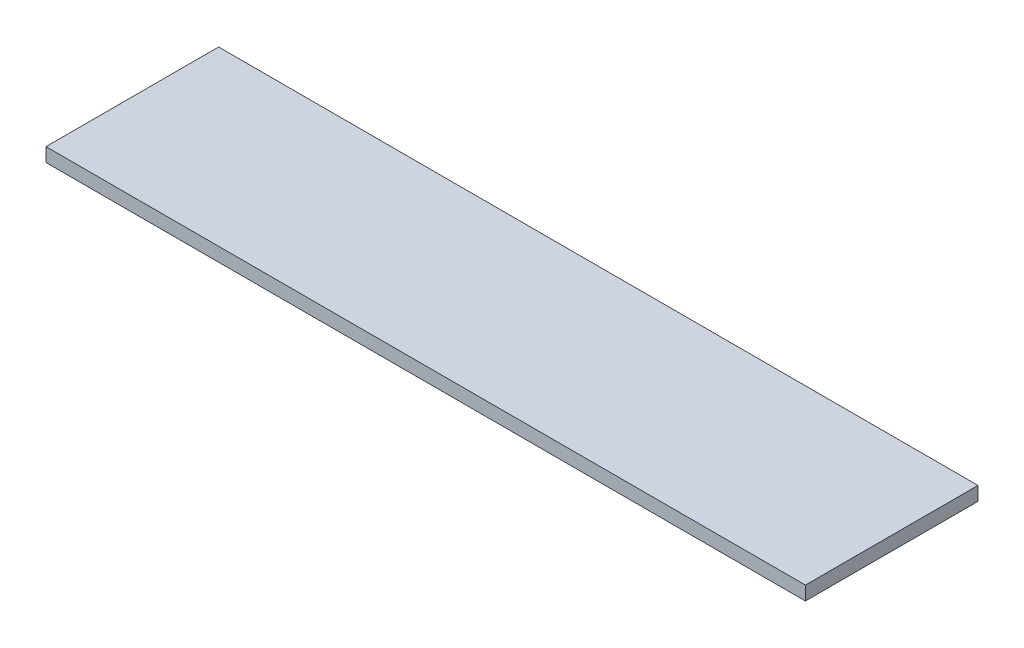
ISO-10303-21;
HEADER;
FILE_DESCRIPTION(('STEP AP214'),'2;1');
FILE_NAME('part.step','',(''),(''),'','','');
FILE_SCHEMA(('AUTOMOTIVE_DESIGN { 1 0 10303 214 1 1 1 1 }'));
ENDSEC;
DATA;
#1=APPLICATION_CONTEXT('core data for automotive mechanical design processes');
#2=APPLICATION_PROTOCOL_DEFINITION('international standard','automotive_design',2000,#1);
#3=PRODUCT_CONTEXT('',#1,'mechanical');
#4=PRODUCT('Part','Part','',(#3));
#5=PRODUCT_RELATED_PRODUCT_CATEGORY('part','',(#4));
#6=PRODUCT_DEFINITION_FORMATION('','',#4);
#7=PRODUCT_DEFINITION_CONTEXT('part definition',#1,'design');
#8=PRODUCT_DEFINITION('design','',#6,#7);
#9=PRODUCT_DEFINITION_SHAPE('','',#8);
#10=(LENGTH_UNIT() NAMED_UNIT(*) SI_UNIT(.MILLI.,.METRE.));
#11=(NAMED_UNIT(*) PLANE_ANGLE_UNIT() SI_UNIT($,.RADIAN.));
#12=(NAMED_UNIT(*) SI_UNIT($,.STERADIAN.) SOLID_ANGLE_UNIT());
#13=UNCERTAINTY_MEASURE_WITH_UNIT(LENGTH_MEASURE(1.E-05),#10,'distance_accuracy_value','');
#14=(GEOMETRIC_REPRESENTATION_CONTEXT(3) GLOBAL_UNCERTAINTY_ASSIGNED_CONTEXT((#13)) GLOBAL_UNIT_ASSIGNED_CONTEXT((#10,
#11,#12)) REPRESENTATION_CONTEXT('',''));
#15=CARTESIAN_POINT('',(0.,0.,0.));
#16=DIRECTION('',(0.,0.,1.));
#17=DIRECTION('',(1.,0.,0.));
#18=AXIS2_PLACEMENT_3D('',#15,#16,#17);
#19=CARTESIAN_POINT('',(110.,0.999999999999999,-12.5));
#20=DIRECTION('',(0.,0.,1.));
#21=DIRECTION('',(1.,0.,0.));
#22=AXIS2_PLACEMENT_3D('',#19,#20,#21);
#23=PLANE('',#22);
#24=DIRECTION('',(0.,1.,0.));
#25=VECTOR('',#24,1.);
#26=CARTESIAN_POINT('',(0.,0.999999999999999,-12.5));
#27=LINE('',#26,#25);
#28=CARTESIAN_POINT('',(0.,-1.,-12.5));
#29=VERTEX_POINT('',#28);
#30=CARTESIAN_POINT('',(0.,0.999999999999999,-12.5));
#31=VERTEX_POINT('',#30);
#32=EDGE_CURVE('E107',#29,#31,#27,.T.);
#33=ORIENTED_EDGE('',*,*,#32,.T.);
#34=DIRECTION('',(-1.,0.,0.));
#35=VECTOR('',#34,1.);
#36=CARTESIAN_POINT('',(110.,0.999999999999999,-12.5));
#37=LINE('',#36,#35);
#38=CARTESIAN_POINT('',(110.,0.999999999999999,-12.5));
#39=VERTEX_POINT('',#38);
#40=EDGE_CURVE('E11',#39,#31,#37,.T.);
#41=ORIENTED_EDGE('',*,*,#40,.F.);
#42=DIRECTION('',(0.,1.,0.));
#43=VECTOR('',#42,1.);
#44=CARTESIAN_POINT('',(110.,0.999999999999999,-12.5));
#45=LINE('',#44,#43);
#46=CARTESIAN_POINT('',(110.,-1.,-12.5));
#47=VERTEX_POINT('',#46);
#48=EDGE_CURVE('E91',#47,#39,#45,.T.);
#49=ORIENTED_EDGE('',*,*,#48,.F.);
#50=DIRECTION('',(-1.,0.,0.));
#51=VECTOR('',#50,1.);
#52=CARTESIAN_POINT('',(110.,-1.,-12.5));
#53=LINE('',#52,#51);
#54=EDGE_CURVE('E103',#47,#29,#53,.T.);
#55=ORIENTED_EDGE('',*,*,#54,.T.);
#56=EDGE_LOOP('',(#33,#41,#49,#55));
#57=FACE_BOUND('',#56,.T.);
#58=ADVANCED_FACE('F39',(#57),#23,.F.);
#59=CARTESIAN_POINT('',(110.,0.999999999999999,12.5));
#60=DIRECTION('',(0.,-1.,0.));
#61=DIRECTION('',(0.,0.,-1.));
#62=AXIS2_PLACEMENT_3D('',#59,#60,#61);
#63=PLANE('',#62);
#64=DIRECTION('',(0.,0.,1.));
#65=VECTOR('',#64,1.);
#66=CARTESIAN_POINT('',(0.,0.999999999999999,12.5));
#67=LINE('',#66,#65);
#68=CARTESIAN_POINT('',(0.,0.999999999999999,12.5));
#69=VERTEX_POINT('',#68);
#70=EDGE_CURVE('E96',#31,#69,#67,.T.);
#71=ORIENTED_EDGE('',*,*,#70,.T.);
#72=DIRECTION('',(-1.,0.,0.));
#73=VECTOR('',#72,1.);
#74=CARTESIAN_POINT('',(110.,0.999999999999999,12.5));
#75=LINE('',#74,#73);
#76=CARTESIAN_POINT('',(110.,0.999999999999999,12.5));
#77=VERTEX_POINT('',#76);
#78=EDGE_CURVE('E48',#77,#69,#75,.T.);
#79=ORIENTED_EDGE('',*,*,#78,.F.);
#80=DIRECTION('',(0.,0.,1.));
#81=VECTOR('',#80,1.);
#82=CARTESIAN_POINT('',(110.,0.999999999999999,12.5));
#83=LINE('',#82,#81);
#84=EDGE_CURVE('E86',#39,#77,#83,.T.);
#85=ORIENTED_EDGE('',*,*,#84,.F.);
#86=ORIENTED_EDGE('',*,*,#40,.T.);
#87=EDGE_LOOP('',(#71,#79,#85,#86));
#88=FACE_BOUND('',#87,.T.);
#89=ADVANCED_FACE('F95',(#88),#63,.F.);
#90=CARTESIAN_POINT('',(110.,0.999999999999999,12.5));
#91=DIRECTION('',(0.,0.,-1.));
#92=DIRECTION('',(-1.,0.,0.));
#93=AXIS2_PLACEMENT_3D('',#90,#91,#92);
#94=PLANE('',#93);
#95=DIRECTION('',(0.,-1.,0.));
#96=VECTOR('',#95,1.);
#97=CARTESIAN_POINT('',(0.,0.999999999999999,12.5));
#98=LINE('',#97,#96);
#99=CARTESIAN_POINT('',(0.,-1.,12.5));
#100=VERTEX_POINT('',#99);
#101=EDGE_CURVE('E73',#69,#100,#98,.T.);
#102=ORIENTED_EDGE('',*,*,#101,.T.);
#103=DIRECTION('',(-1.,0.,0.));
#104=VECTOR('',#103,1.);
#105=CARTESIAN_POINT('',(110.,-1.,12.5));
#106=LINE('',#105,#104);
#107=CARTESIAN_POINT('',(110.,-1.,12.5));
#108=VERTEX_POINT('',#107);
#109=EDGE_CURVE('E98',#108,#100,#106,.T.);
#110=ORIENTED_EDGE('',*,*,#109,.F.);
#111=DIRECTION('',(0.,-1.,0.));
#112=VECTOR('',#111,1.);
#113=CARTESIAN_POINT('',(110.,0.999999999999999,12.5));
#114=LINE('',#113,#112);
#115=EDGE_CURVE('E89',#77,#108,#114,.T.);
#116=ORIENTED_EDGE('',*,*,#115,.F.);
#117=ORIENTED_EDGE('',*,*,#78,.T.);
#118=EDGE_LOOP('',(#102,#110,#116,#117));
#119=FACE_BOUND('',#118,.T.);
#120=ADVANCED_FACE('F99',(#119),#94,.F.);
#121=CARTESIAN_POINT('',(110.,-1.,12.5));
#122=DIRECTION('',(0.,1.,0.));
#123=DIRECTION('',(0.,0.,1.));
#124=AXIS2_PLACEMENT_3D('',#121,#122,#123);
#125=PLANE('',#124);
#126=DIRECTION('',(0.,0.,-1.));
#127=VECTOR('',#126,1.);
#128=CARTESIAN_POINT('',(0.,-1.,12.5));
#129=LINE('',#128,#127);
#130=EDGE_CURVE('E79',#100,#29,#129,.T.);
#131=ORIENTED_EDGE('',*,*,#130,.T.);
#132=ORIENTED_EDGE('',*,*,#54,.F.);
#133=DIRECTION('',(0.,0.,-1.));
#134=VECTOR('',#133,1.);
#135=CARTESIAN_POINT('',(110.,-1.,12.5));
#136=LINE('',#135,#134);
#137=EDGE_CURVE('E56',#108,#47,#136,.T.);
#138=ORIENTED_EDGE('',*,*,#137,.F.);
#139=ORIENTED_EDGE('',*,*,#109,.T.);
#140=EDGE_LOOP('',(#131,#132,#138,#139));
#141=FACE_BOUND('',#140,.T.);
#142=ADVANCED_FACE('F120',(#141),#125,.F.);
#143=CARTESIAN_POINT('',(110.,0.,0.));
#144=DIRECTION('',(1.,0.,0.));
#145=DIRECTION('',(0.,0.,-1.));
#146=AXIS2_PLACEMENT_3D('',#143,#144,#145);
#147=PLANE('',#146);
#148=ORIENTED_EDGE('',*,*,#48,.T.);
#149=ORIENTED_EDGE('',*,*,#84,.T.);
#150=ORIENTED_EDGE('',*,*,#115,.T.);
#151=ORIENTED_EDGE('',*,*,#137,.T.);
#152=EDGE_LOOP('',(#148,#149,#150,#151));
#153=FACE_BOUND('',#152,.T.);
#154=ADVANCED_FACE('F87',(#153),#147,.T.);
#155=CARTESIAN_POINT('',(0.,0.,0.));
#156=DIRECTION('',(1.,0.,0.));
#157=DIRECTION('',(0.,0.,-1.));
#158=AXIS2_PLACEMENT_3D('',#155,#156,#157);
#159=PLANE('',#158);
#160=ORIENTED_EDGE('',*,*,#32,.F.);
#161=ORIENTED_EDGE('',*,*,#130,.F.);
#162=ORIENTED_EDGE('',*,*,#101,.F.);
#163=ORIENTED_EDGE('',*,*,#70,.F.);
#164=EDGE_LOOP('',(#160,#161,#162,#163));
#165=FACE_BOUND('',#164,.T.);
#166=ADVANCED_FACE('F123',(#165),#159,.F.);
#167=CLOSED_SHELL('',(#58,#89,#120,#142,#154,#166));
#168=MANIFOLD_SOLID_BREP('B2',#167);
#169=ADVANCED_BREP_SHAPE_REPRESENTATION('',(#18,#168),#14);
#170=SHAPE_DEFINITION_REPRESENTATION(#9,#169);
ENDSEC;
END-ISO-10303-21;
